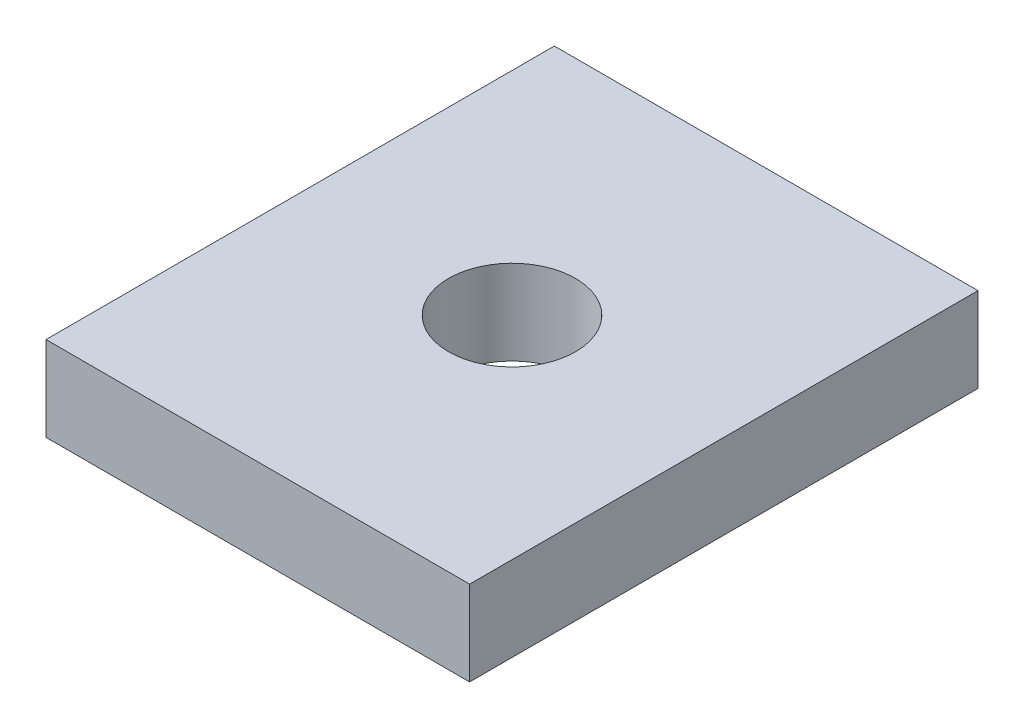
ISO-10303-21;
HEADER;
FILE_DESCRIPTION(('STEP AP214'),'2;1');
FILE_NAME('part.step','',(''),(''),'','','');
FILE_SCHEMA(('AUTOMOTIVE_DESIGN { 1 0 10303 214 1 1 1 1 }'));
ENDSEC;
DATA;
#1=APPLICATION_CONTEXT('core data for automotive mechanical design processes');
#2=APPLICATION_PROTOCOL_DEFINITION('international standard','automotive_design',2000,#1);
#3=PRODUCT_CONTEXT('',#1,'mechanical');
#4=PRODUCT('Part','Part','',(#3));
#5=PRODUCT_RELATED_PRODUCT_CATEGORY('part','',(#4));
#6=PRODUCT_DEFINITION_FORMATION('','',#4);
#7=PRODUCT_DEFINITION_CONTEXT('part definition',#1,'design');
#8=PRODUCT_DEFINITION('design','',#6,#7);
#9=PRODUCT_DEFINITION_SHAPE('','',#8);
#10=(LENGTH_UNIT() NAMED_UNIT(*) SI_UNIT(.MILLI.,.METRE.));
#11=(NAMED_UNIT(*) PLANE_ANGLE_UNIT() SI_UNIT($,.RADIAN.));
#12=(NAMED_UNIT(*) SI_UNIT($,.STERADIAN.) SOLID_ANGLE_UNIT());
#13=UNCERTAINTY_MEASURE_WITH_UNIT(LENGTH_MEASURE(1.E-05),#10,'distance_accuracy_value','');
#14=(GEOMETRIC_REPRESENTATION_CONTEXT(3) GLOBAL_UNCERTAINTY_ASSIGNED_CONTEXT((#13)) GLOBAL_UNIT_ASSIGNED_CONTEXT((#10,
#11,#12)) REPRESENTATION_CONTEXT('',''));
#15=CARTESIAN_POINT('',(0.,0.,0.));
#16=DIRECTION('',(0.,0.,1.));
#17=DIRECTION('',(1.,0.,0.));
#18=AXIS2_PLACEMENT_3D('',#15,#16,#17);
#19=CARTESIAN_POINT('',(100.,40.,-120.));
#20=DIRECTION('',(1.,0.,0.));
#21=DIRECTION('',(0.,0.,-1.));
#22=AXIS2_PLACEMENT_3D('',#19,#20,#21);
#23=PLANE('',#22);
#24=DIRECTION('',(0.,0.,1.));
#25=VECTOR('',#24,1.);
#26=CARTESIAN_POINT('',(100.,0.,-120.));
#27=LINE('',#26,#25);
#28=CARTESIAN_POINT('',(100.,0.,-120.));
#29=VERTEX_POINT('',#28);
#30=CARTESIAN_POINT('',(100.,0.,120.));
#31=VERTEX_POINT('',#30);
#32=EDGE_CURVE('E99',#29,#31,#27,.T.);
#33=ORIENTED_EDGE('',*,*,#32,.F.);
#34=DIRECTION('',(0.,-1.,0.));
#35=VECTOR('',#34,1.);
#36=CARTESIAN_POINT('',(100.,40.,-120.));
#37=LINE('',#36,#35);
#38=CARTESIAN_POINT('',(100.,40.,-120.));
#39=VERTEX_POINT('',#38);
#40=EDGE_CURVE('E11',#39,#29,#37,.T.);
#41=ORIENTED_EDGE('',*,*,#40,.F.);
#42=DIRECTION('',(0.,0.,1.));
#43=VECTOR('',#42,1.);
#44=CARTESIAN_POINT('',(100.,40.,-120.));
#45=LINE('',#44,#43);
#46=CARTESIAN_POINT('',(100.,40.,120.));
#47=VERTEX_POINT('',#46);
#48=EDGE_CURVE('E93',#39,#47,#45,.T.);
#49=ORIENTED_EDGE('',*,*,#48,.T.);
#50=DIRECTION('',(0.,-1.,0.));
#51=VECTOR('',#50,1.);
#52=CARTESIAN_POINT('',(100.,40.,120.));
#53=LINE('',#52,#51);
#54=EDGE_CURVE('E36',#47,#31,#53,.T.);
#55=ORIENTED_EDGE('',*,*,#54,.T.);
#56=EDGE_LOOP('',(#33,#41,#49,#55));
#57=FACE_BOUND('',#56,.T.);
#58=ADVANCED_FACE('F33',(#57),#23,.T.);
#59=CARTESIAN_POINT('',(100.,40.,-120.));
#60=DIRECTION('',(0.,0.,1.));
#61=DIRECTION('',(1.,0.,0.));
#62=AXIS2_PLACEMENT_3D('',#59,#60,#61);
#63=PLANE('',#62);
#64=DIRECTION('',(-1.,0.,0.));
#65=VECTOR('',#64,1.);
#66=CARTESIAN_POINT('',(100.,0.,-120.));
#67=LINE('',#66,#65);
#68=CARTESIAN_POINT('',(-100.,0.,-120.));
#69=VERTEX_POINT('',#68);
#70=EDGE_CURVE('E66',#29,#69,#67,.T.);
#71=ORIENTED_EDGE('',*,*,#70,.T.);
#72=DIRECTION('',(0.,-1.,0.));
#73=VECTOR('',#72,1.);
#74=CARTESIAN_POINT('',(-100.,40.,-120.));
#75=LINE('',#74,#73);
#76=CARTESIAN_POINT('',(-100.,40.,-120.));
#77=VERTEX_POINT('',#76);
#78=EDGE_CURVE('E42',#77,#69,#75,.T.);
#79=ORIENTED_EDGE('',*,*,#78,.F.);
#80=DIRECTION('',(-1.,0.,0.));
#81=VECTOR('',#80,1.);
#82=CARTESIAN_POINT('',(100.,40.,-120.));
#83=LINE('',#82,#81);
#84=EDGE_CURVE('E83',#39,#77,#83,.T.);
#85=ORIENTED_EDGE('',*,*,#84,.F.);
#86=ORIENTED_EDGE('',*,*,#40,.T.);
#87=EDGE_LOOP('',(#71,#79,#85,#86));
#88=FACE_BOUND('',#87,.T.);
#89=ADVANCED_FACE('F110',(#88),#63,.F.);
#90=CARTESIAN_POINT('',(-100.,40.,-120.));
#91=DIRECTION('',(1.,0.,0.));
#92=DIRECTION('',(0.,0.,-1.));
#93=AXIS2_PLACEMENT_3D('',#90,#91,#92);
#94=PLANE('',#93);
#95=DIRECTION('',(0.,0.,1.));
#96=VECTOR('',#95,1.);
#97=CARTESIAN_POINT('',(-100.,0.,-120.));
#98=LINE('',#97,#96);
#99=CARTESIAN_POINT('',(-100.,0.,120.));
#100=VERTEX_POINT('',#99);
#101=EDGE_CURVE('E90',#69,#100,#98,.T.);
#102=ORIENTED_EDGE('',*,*,#101,.T.);
#103=DIRECTION('',(0.,-1.,0.));
#104=VECTOR('',#103,1.);
#105=CARTESIAN_POINT('',(-100.,40.,120.));
#106=LINE('',#105,#104);
#107=CARTESIAN_POINT('',(-100.,40.,120.));
#108=VERTEX_POINT('',#107);
#109=EDGE_CURVE('E87',#108,#100,#106,.T.);
#110=ORIENTED_EDGE('',*,*,#109,.F.);
#111=DIRECTION('',(0.,0.,1.));
#112=VECTOR('',#111,1.);
#113=CARTESIAN_POINT('',(-100.,40.,-120.));
#114=LINE('',#113,#112);
#115=EDGE_CURVE('E78',#77,#108,#114,.T.);
#116=ORIENTED_EDGE('',*,*,#115,.F.);
#117=ORIENTED_EDGE('',*,*,#78,.T.);
#118=EDGE_LOOP('',(#102,#110,#116,#117));
#119=FACE_BOUND('',#118,.T.);
#120=ADVANCED_FACE('F88',(#119),#94,.F.);
#121=CARTESIAN_POINT('',(100.,40.,120.));
#122=DIRECTION('',(0.,0.,1.));
#123=DIRECTION('',(1.,0.,0.));
#124=AXIS2_PLACEMENT_3D('',#121,#122,#123);
#125=PLANE('',#124);
#126=DIRECTION('',(-1.,0.,0.));
#127=VECTOR('',#126,1.);
#128=CARTESIAN_POINT('',(100.,0.,120.));
#129=LINE('',#128,#127);
#130=EDGE_CURVE('E102',#31,#100,#129,.T.);
#131=ORIENTED_EDGE('',*,*,#130,.F.);
#132=ORIENTED_EDGE('',*,*,#54,.F.);
#133=DIRECTION('',(-1.,0.,0.));
#134=VECTOR('',#133,1.);
#135=CARTESIAN_POINT('',(100.,40.,120.));
#136=LINE('',#135,#134);
#137=EDGE_CURVE('E82',#47,#108,#136,.T.);
#138=ORIENTED_EDGE('',*,*,#137,.T.);
#139=ORIENTED_EDGE('',*,*,#109,.T.);
#140=EDGE_LOOP('',(#131,#132,#138,#139));
#141=FACE_BOUND('',#140,.T.);
#142=ADVANCED_FACE('F92',(#141),#125,.T.);
#143=CARTESIAN_POINT('',(0.,40.,0.));
#144=DIRECTION('',(0.,-1.,0.));
#145=DIRECTION('',(0.,0.,-1.));
#146=AXIS2_PLACEMENT_3D('',#143,#144,#145);
#147=PLANE('',#146);
#148=CARTESIAN_POINT('',(0.,40.,0.));
#149=DIRECTION('',(0.,1.,0.));
#150=DIRECTION('',(0.,0.,1.));
#151=AXIS2_PLACEMENT_3D('',#148,#149,#150);
#152=CIRCLE('',#151,30.);
#153=CARTESIAN_POINT('',(0.,40.,30.));
#154=VERTEX_POINT('',#153);
#155=EDGE_CURVE('E141',#154,#154,#152,.T.);
#156=ORIENTED_EDGE('',*,*,#155,.F.);
#157=EDGE_LOOP('',(#156));
#158=FACE_BOUND('',#157,.T.);
#159=ORIENTED_EDGE('',*,*,#48,.F.);
#160=ORIENTED_EDGE('',*,*,#84,.T.);
#161=ORIENTED_EDGE('',*,*,#115,.T.);
#162=ORIENTED_EDGE('',*,*,#137,.F.);
#163=EDGE_LOOP('',(#159,#160,#161,#162));
#164=FACE_BOUND('',#163,.T.);
#165=ADVANCED_FACE('F81',(#158,#164),#147,.F.);
#166=CARTESIAN_POINT('',(0.,0.,0.));
#167=DIRECTION('',(0.,-1.,0.));
#168=DIRECTION('',(0.,0.,-1.));
#169=AXIS2_PLACEMENT_3D('',#166,#167,#168);
#170=PLANE('',#169);
#171=CARTESIAN_POINT('',(0.,0.,0.));
#172=DIRECTION('',(0.,1.,0.));
#173=DIRECTION('',(0.,0.,1.));
#174=AXIS2_PLACEMENT_3D('',#171,#172,#173);
#175=CIRCLE('',#174,30.);
#176=CARTESIAN_POINT('',(0.,0.,30.));
#177=VERTEX_POINT('',#176);
#178=EDGE_CURVE('E103',#177,#177,#175,.T.);
#179=ORIENTED_EDGE('',*,*,#178,.T.);
#180=EDGE_LOOP('',(#179));
#181=FACE_BOUND('',#180,.T.);
#182=ORIENTED_EDGE('',*,*,#32,.T.);
#183=ORIENTED_EDGE('',*,*,#130,.T.);
#184=ORIENTED_EDGE('',*,*,#101,.F.);
#185=ORIENTED_EDGE('',*,*,#70,.F.);
#186=EDGE_LOOP('',(#182,#183,#184,#185));
#187=FACE_BOUND('',#186,.T.);
#188=ADVANCED_FACE('F108',(#181,#187),#170,.T.);
#189=CARTESIAN_POINT('',(0.,0.,0.));
#190=DIRECTION('',(0.,1.,0.));
#191=DIRECTION('',(0.,0.,1.));
#192=AXIS2_PLACEMENT_3D('',#189,#190,#191);
#193=CYLINDRICAL_SURFACE('',#192,30.);
#194=ORIENTED_EDGE('',*,*,#178,.F.);
#195=EDGE_LOOP('',(#194));
#196=FACE_BOUND('',#195,.T.);
#197=ORIENTED_EDGE('',*,*,#155,.T.);
#198=EDGE_LOOP('',(#197));
#199=FACE_BOUND('',#198,.T.);
#200=ADVANCED_FACE('F129',(#196,#199),#193,.F.);
#201=CLOSED_SHELL('',(#58,#89,#120,#142,#165,#188,#200));
#202=MANIFOLD_SOLID_BREP('B2',#201);
#203=ADVANCED_BREP_SHAPE_REPRESENTATION('',(#18,#202),#14);
#204=SHAPE_DEFINITION_REPRESENTATION(#9,#203);
ENDSEC;
END-ISO-10303-21;
